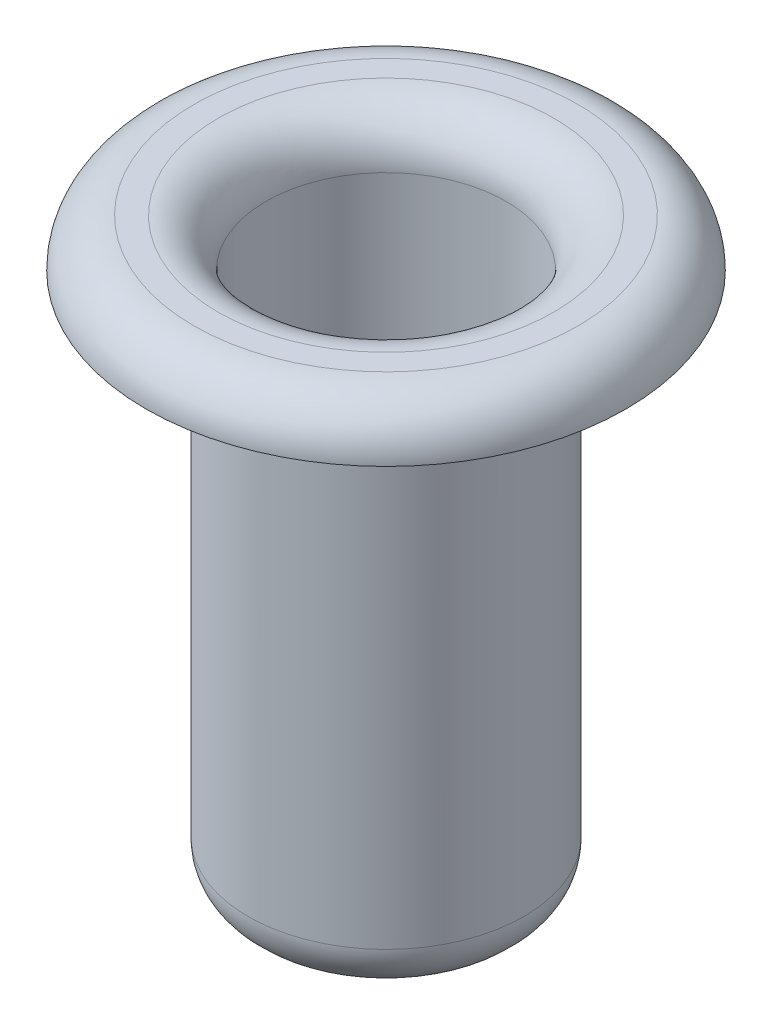
ISO-10303-21;
HEADER;
FILE_DESCRIPTION(('STEP AP214'),'2;1');
FILE_NAME('part.step','',(''),(''),'','','');
FILE_SCHEMA(('AUTOMOTIVE_DESIGN { 1 0 10303 214 1 1 1 1 }'));
ENDSEC;
DATA;
#1=APPLICATION_CONTEXT('core data for automotive mechanical design processes');
#2=APPLICATION_PROTOCOL_DEFINITION('international standard','automotive_design',2000,#1);
#3=PRODUCT_CONTEXT('',#1,'mechanical');
#4=PRODUCT('Part','Part','',(#3));
#5=PRODUCT_RELATED_PRODUCT_CATEGORY('part','',(#4));
#6=PRODUCT_DEFINITION_FORMATION('','',#4);
#7=PRODUCT_DEFINITION_CONTEXT('part definition',#1,'design');
#8=PRODUCT_DEFINITION('design','',#6,#7);
#9=PRODUCT_DEFINITION_SHAPE('','',#8);
#10=(LENGTH_UNIT() NAMED_UNIT(*) SI_UNIT(.MILLI.,.METRE.));
#11=(NAMED_UNIT(*) PLANE_ANGLE_UNIT() SI_UNIT($,.RADIAN.));
#12=(NAMED_UNIT(*) SI_UNIT($,.STERADIAN.) SOLID_ANGLE_UNIT());
#13=UNCERTAINTY_MEASURE_WITH_UNIT(LENGTH_MEASURE(1.E-05),#10,'distance_accuracy_value','');
#14=(GEOMETRIC_REPRESENTATION_CONTEXT(3) GLOBAL_UNCERTAINTY_ASSIGNED_CONTEXT((#13)) GLOBAL_UNIT_ASSIGNED_CONTEXT((#10,
#11,#12)) REPRESENTATION_CONTEXT('',''));
#15=CARTESIAN_POINT('',(0.,0.,0.));
#16=DIRECTION('',(0.,0.,1.));
#17=DIRECTION('',(1.,0.,0.));
#18=AXIS2_PLACEMENT_3D('',#15,#16,#17);
#19=CARTESIAN_POINT('',(0.,5.588,0.));
#20=DIRECTION('',(0.,-1.,0.));
#21=DIRECTION('',(0.,0.,-1.));
#22=AXIS2_PLACEMENT_3D('',#19,#20,#21);
#23=CYLINDRICAL_SURFACE('',#22,1.4605);
#24=CARTESIAN_POINT('',(0.,0.396557372898299,0.));
#25=DIRECTION('',(0.,-1.,0.));
#26=DIRECTION('',(0.,0.,-1.));
#27=AXIS2_PLACEMENT_3D('',#24,#25,#26);
#28=CIRCLE('',#27,1.4605);
#29=CARTESIAN_POINT('',(0.,0.396557372898299,-1.4605));
#30=VERTEX_POINT('',#29);
#31=EDGE_CURVE('E46',#30,#30,#28,.F.);
#32=ORIENTED_EDGE('',*,*,#31,.T.);
#33=EDGE_LOOP('',(#32));
#34=FACE_BOUND('',#33,.T.);
#35=CARTESIAN_POINT('',(0.,5.588,0.));
#36=DIRECTION('',(0.,1.,0.));
#37=DIRECTION('',(0.,0.,1.));
#38=AXIS2_PLACEMENT_3D('',#35,#36,#37);
#39=CIRCLE('',#38,1.4605);
#40=CARTESIAN_POINT('',(0.,5.588,1.4605));
#41=VERTEX_POINT('',#40);
#42=EDGE_CURVE('E51',#41,#41,#39,.T.);
#43=ORIENTED_EDGE('',*,*,#42,.F.);
#44=EDGE_LOOP('',(#43));
#45=FACE_BOUND('',#44,.T.);
#46=ADVANCED_FACE('F31',(#34,#45),#23,.T.);
#47=CARTESIAN_POINT('',(0.,5.588,0.));
#48=DIRECTION('',(0.,1.,0.));
#49=DIRECTION('',(0.,0.,1.));
#50=AXIS2_PLACEMENT_3D('',#47,#48,#49);
#51=PLANE('',#50);
#52=CARTESIAN_POINT('',(0.,5.588,0.));
#53=DIRECTION('',(0.,1.,0.));
#54=DIRECTION('',(0.,0.,1.));
#55=AXIS2_PLACEMENT_3D('',#52,#53,#54);
#56=CIRCLE('',#55,2.54);
#57=CARTESIAN_POINT('',(0.,5.588,2.54));
#58=VERTEX_POINT('',#57);
#59=EDGE_CURVE('E54',#58,#58,#56,.T.);
#60=ORIENTED_EDGE('',*,*,#59,.F.);
#61=EDGE_LOOP('',(#60));
#62=FACE_BOUND('',#61,.T.);
#63=ORIENTED_EDGE('',*,*,#42,.T.);
#64=EDGE_LOOP('',(#63));
#65=FACE_BOUND('',#64,.T.);
#66=ADVANCED_FACE('F74',(#62,#65),#51,.F.);
#67=CARTESIAN_POINT('',(0.,6.096,0.));
#68=DIRECTION('',(0.,1.,0.));
#69=DIRECTION('',(0.,0.,1.));
#70=AXIS2_PLACEMENT_3D('',#67,#68,#69);
#71=PLANE('',#70);
#72=CARTESIAN_POINT('',(0.,6.096,0.));
#73=DIRECTION('',(0.,1.,0.));
#74=DIRECTION('',(0.,0.,1.));
#75=AXIS2_PLACEMENT_3D('',#72,#73,#74);
#76=CIRCLE('',#75,2.032);
#77=CARTESIAN_POINT('',(0.,6.096,2.032));
#78=VERTEX_POINT('',#77);
#79=EDGE_CURVE('E38',#78,#78,#76,.T.);
#80=ORIENTED_EDGE('',*,*,#79,.T.);
#81=EDGE_LOOP('',(#80));
#82=FACE_BOUND('',#81,.T.);
#83=CARTESIAN_POINT('',(0.,6.096,0.));
#84=DIRECTION('',(0.,1.,0.));
#85=DIRECTION('',(0.,0.,1.));
#86=AXIS2_PLACEMENT_3D('',#83,#84,#85);
#87=CIRCLE('',#86,1.778);
#88=CARTESIAN_POINT('',(0.,6.096,1.778));
#89=VERTEX_POINT('',#88);
#90=EDGE_CURVE('E42',#89,#89,#87,.F.);
#91=ORIENTED_EDGE('',*,*,#90,.T.);
#92=EDGE_LOOP('',(#91));
#93=FACE_BOUND('',#92,.T.);
#94=ADVANCED_FACE('F66',(#82,#93),#71,.T.);
#95=CARTESIAN_POINT('',(0.,0.,0.));
#96=DIRECTION('',(0.,1.,0.));
#97=DIRECTION('',(0.,0.,1.));
#98=AXIS2_PLACEMENT_3D('',#95,#96,#97);
#99=CYLINDRICAL_SURFACE('',#98,1.27);
#100=CARTESIAN_POINT('',(0.,5.588,0.));
#101=DIRECTION('',(0.,1.,0.));
#102=DIRECTION('',(0.,0.,1.));
#103=AXIS2_PLACEMENT_3D('',#100,#101,#102);
#104=CIRCLE('',#103,1.27);
#105=CARTESIAN_POINT('',(0.,5.588,1.27));
#106=VERTEX_POINT('',#105);
#107=EDGE_CURVE('E10',#106,#106,#104,.T.);
#108=CARTESIAN_POINT('',(0.,0.,0.));
#109=DIRECTION('',(0.,1.,0.));
#110=DIRECTION('',(0.,0.,1.));
#111=AXIS2_PLACEMENT_3D('',#108,#109,#110);
#112=CIRCLE('',#111,1.27);
#113=CARTESIAN_POINT('',(0.,0.,1.27));
#114=VERTEX_POINT('',#113);
#115=EDGE_CURVE('E57',#114,#114,#112,.T.);
#116=CARTESIAN_POINT('',(0.,5.588,1.27));
#117=CARTESIAN_POINT('',(0.,5.52979166666666,1.27));
#118=CARTESIAN_POINT('',(0.,5.47158333333333,1.27));
#119=CARTESIAN_POINT('',(0.,5.35516666666667,1.27));
#120=CARTESIAN_POINT('',(0.,5.29695833333333,1.27));
#121=CARTESIAN_POINT('',(0.,5.18054166666666,1.27));
#122=CARTESIAN_POINT('',(0.,5.12233333333333,1.27));
#123=CARTESIAN_POINT('',(0.,5.00591666666667,1.27));
#124=CARTESIAN_POINT('',(0.,4.94770833333333,1.27));
#125=CARTESIAN_POINT('',(0.,4.83129166666667,1.27));
#126=CARTESIAN_POINT('',(0.,4.77308333333333,1.27));
#127=CARTESIAN_POINT('',(0.,4.65666666666666,1.27));
#128=CARTESIAN_POINT('',(0.,4.59845833333333,1.27));
#129=CARTESIAN_POINT('',(0.,4.48204166666667,1.27));
#130=CARTESIAN_POINT('',(0.,4.42383333333333,1.27));
#131=CARTESIAN_POINT('',(0.,4.30741666666666,1.27));
#132=CARTESIAN_POINT('',(0.,4.24920833333333,1.27));
#133=CARTESIAN_POINT('',(0.,4.13279166666667,1.27));
#134=CARTESIAN_POINT('',(0.,4.07458333333333,1.27));
#135=CARTESIAN_POINT('',(0.,3.95816666666667,1.27));
#136=CARTESIAN_POINT('',(0.,3.89995833333333,1.27));
#137=CARTESIAN_POINT('',(0.,3.78354166666667,1.27));
#138=CARTESIAN_POINT('',(0.,3.72533333333333,1.27));
#139=CARTESIAN_POINT('',(0.,3.60891666666667,1.27));
#140=CARTESIAN_POINT('',(0.,3.55070833333333,1.27));
#141=CARTESIAN_POINT('',(0.,3.43429166666667,1.27));
#142=CARTESIAN_POINT('',(0.,3.37608333333333,1.27));
#143=CARTESIAN_POINT('',(0.,3.25966666666667,1.27));
#144=CARTESIAN_POINT('',(0.,3.20145833333333,1.27));
#145=CARTESIAN_POINT('',(0.,3.08504166666667,1.27));
#146=CARTESIAN_POINT('',(0.,3.02683333333333,1.27));
#147=CARTESIAN_POINT('',(0.,2.91041666666667,1.27));
#148=CARTESIAN_POINT('',(0.,2.85220833333333,1.27));
#149=CARTESIAN_POINT('',(0.,2.73579166666667,1.27));
#150=CARTESIAN_POINT('',(0.,2.67758333333333,1.27));
#151=CARTESIAN_POINT('',(0.,2.56116666666667,1.27));
#152=CARTESIAN_POINT('',(0.,2.50295833333333,1.27));
#153=CARTESIAN_POINT('',(0.,2.38654166666667,1.27));
#154=CARTESIAN_POINT('',(0.,2.32833333333333,1.27));
#155=CARTESIAN_POINT('',(0.,2.21191666666667,1.27));
#156=CARTESIAN_POINT('',(0.,2.15370833333333,1.27));
#157=CARTESIAN_POINT('',(0.,2.03729166666667,1.27));
#158=CARTESIAN_POINT('',(0.,1.97908333333333,1.27));
#159=CARTESIAN_POINT('',(0.,1.86266666666667,1.27));
#160=CARTESIAN_POINT('',(0.,1.80445833333333,1.27));
#161=CARTESIAN_POINT('',(0.,1.68804166666667,1.27));
#162=CARTESIAN_POINT('',(0.,1.62983333333333,1.27));
#163=CARTESIAN_POINT('',(0.,1.51341666666667,1.27));
#164=CARTESIAN_POINT('',(0.,1.45520833333333,1.27));
#165=CARTESIAN_POINT('',(0.,1.33879166666667,1.27));
#166=CARTESIAN_POINT('',(0.,1.28058333333333,1.27));
#167=CARTESIAN_POINT('',(0.,1.16416666666667,1.27));
#168=CARTESIAN_POINT('',(0.,1.10595833333333,1.27));
#169=CARTESIAN_POINT('',(0.,0.989541666666666,1.27));
#170=CARTESIAN_POINT('',(0.,0.931333333333333,1.27));
#171=CARTESIAN_POINT('',(0.,0.814916666666666,1.27));
#172=CARTESIAN_POINT('',(0.,0.756708333333333,1.27));
#173=CARTESIAN_POINT('',(0.,0.640291666666666,1.27));
#174=CARTESIAN_POINT('',(0.,0.582083333333333,1.27));
#175=CARTESIAN_POINT('',(0.,0.465666666666667,1.27));
#176=CARTESIAN_POINT('',(0.,0.407458333333333,1.27));
#177=CARTESIAN_POINT('',(0.,0.291041666666667,1.27));
#178=CARTESIAN_POINT('',(0.,0.232833333333333,1.27));
#179=CARTESIAN_POINT('',(0.,0.116416666666667,1.27));
#180=CARTESIAN_POINT('',(0.,0.0582083333333334,1.27));
#181=CARTESIAN_POINT('',(0.,0.,1.27));
#182=B_SPLINE_CURVE_WITH_KNOTS('',3,(#116,#117,#118,#119,#120,#121,#122,#123,#124,#125,#126,
#127,#128,#129,#130,#131,#132,#133,#134,#135,#136,#137,#138,#139,#140,#141,#142,#143,#144,#145,
#146,#147,#148,#149,#150,#151,#152,#153,#154,#155,#156,#157,#158,#159,#160,#161,#162,#163,#164,
#165,#166,#167,#168,#169,#170,#171,#172,#173,#174,#175,#176,#177,#178,#179,#180,#181),
.UNSPECIFIED.,.F.,.F.,(4,2,2,2,2,2,2,2,2,2,2,2,2,2,2,2,2,2,2,2,2,2,2,2,2,2,2,2,2,2,2,2,4),(0.,
0.174625,0.34925,0.523875,0.698499999999999,0.873125,1.04775,1.222375,1.397,1.571625,1.74625,
1.920875,2.0955,2.270125,2.44475,2.619375,2.794,2.968625,3.14325,3.317875,3.4925,3.667125,
3.84175,4.016375,4.191,4.365625,4.54025,4.714875,4.8895,5.064125,5.23875,5.413375,5.588),.UNSPECIFIED.);
#183=EDGE_CURVE('BSEAM64',#106,#114,#182,.T.);
#184=ORIENTED_EDGE('',*,*,#107,.T.);
#185=ORIENTED_EDGE('',*,*,#115,.F.);
#186=ORIENTED_EDGE('',*,*,#183,.T.);
#187=ORIENTED_EDGE('',*,*,#183,.F.);
#188=EDGE_LOOP('',(#184,#186,#185,#187));
#189=FACE_BOUND('',#188,.T.);
#190=ADVANCED_FACE('F64',(#189),#99,.F.);
#191=CARTESIAN_POINT('',(0.,0.396557372898298,0.));
#192=DIRECTION('',(0.,-1.,0.));
#193=DIRECTION('',(0.,0.,-1.));
#194=AXIS2_PLACEMENT_3D('',#191,#192,#193);
#195=TOROIDAL_SURFACE('',#194,0.9525,0.508);
#196=ORIENTED_EDGE('',*,*,#115,.T.);
#197=EDGE_LOOP('',(#196));
#198=FACE_BOUND('',#197,.T.);
#199=ORIENTED_EDGE('',*,*,#31,.F.);
#200=EDGE_LOOP('',(#199));
#201=FACE_BOUND('',#200,.T.);
#202=ADVANCED_FACE('F61',(#198,#201),#195,.T.);
#203=CARTESIAN_POINT('',(0.,5.588,0.));
#204=DIRECTION('',(0.,1.,0.));
#205=DIRECTION('',(0.,0.,1.));
#206=AXIS2_PLACEMENT_3D('',#203,#204,#205);
#207=TOROIDAL_SURFACE('',#206,2.032,0.508);
#208=ORIENTED_EDGE('',*,*,#59,.T.);
#209=EDGE_LOOP('',(#208));
#210=FACE_BOUND('',#209,.T.);
#211=ORIENTED_EDGE('',*,*,#79,.F.);
#212=EDGE_LOOP('',(#211));
#213=FACE_BOUND('',#212,.T.);
#214=ADVANCED_FACE('F72',(#210,#213),#207,.T.);
#215=CARTESIAN_POINT('',(0.,5.588,0.));
#216=DIRECTION('',(0.,1.,0.));
#217=DIRECTION('',(0.,0.,1.));
#218=AXIS2_PLACEMENT_3D('',#215,#216,#217);
#219=TOROIDAL_SURFACE('',#218,1.778,0.508);
#220=ORIENTED_EDGE('',*,*,#90,.F.);
#221=EDGE_LOOP('',(#220));
#222=FACE_BOUND('',#221,.T.);
#223=ORIENTED_EDGE('',*,*,#107,.F.);
#224=EDGE_LOOP('',(#223));
#225=FACE_BOUND('',#224,.T.);
#226=ADVANCED_FACE('F33',(#222,#225),#219,.T.);
#227=CLOSED_SHELL('',(#46,#66,#94,#190,#202,#214,#226));
#228=MANIFOLD_SOLID_BREP('B2',#227);
#229=ADVANCED_BREP_SHAPE_REPRESENTATION('',(#18,#228),#14);
#230=SHAPE_DEFINITION_REPRESENTATION(#9,#229);
ENDSEC;
END-ISO-10303-21;
